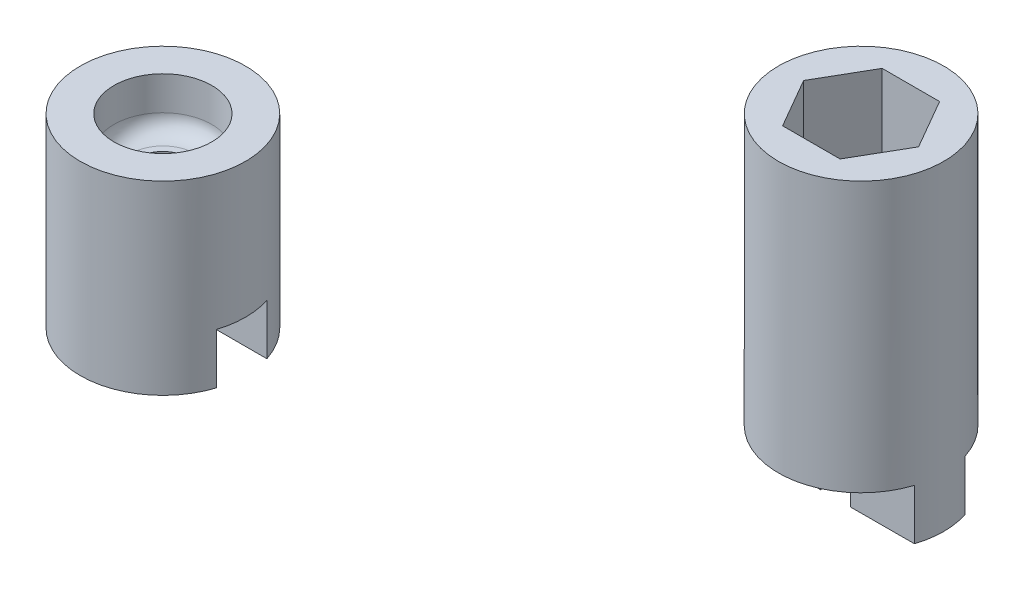
ISO-10303-21;
HEADER;
FILE_DESCRIPTION(('STEP AP214'),'2;1');
FILE_NAME('part.step','',(''),(''),'','','');
FILE_SCHEMA(('AUTOMOTIVE_DESIGN { 1 0 10303 214 1 1 1 1 }'));
ENDSEC;
DATA;
#1=APPLICATION_CONTEXT('core data for automotive mechanical design processes');
#2=APPLICATION_PROTOCOL_DEFINITION('international standard','automotive_design',2000,#1);
#3=PRODUCT_CONTEXT('',#1,'mechanical');
#4=PRODUCT('Part','Part','',(#3));
#5=PRODUCT_RELATED_PRODUCT_CATEGORY('part','',(#4));
#6=PRODUCT_DEFINITION_FORMATION('','',#4);
#7=PRODUCT_DEFINITION_CONTEXT('part definition',#1,'design');
#8=PRODUCT_DEFINITION('design','',#6,#7);
#9=PRODUCT_DEFINITION_SHAPE('','',#8);
#10=(LENGTH_UNIT() NAMED_UNIT(*) SI_UNIT(.MILLI.,.METRE.));
#11=(NAMED_UNIT(*) PLANE_ANGLE_UNIT() SI_UNIT($,.RADIAN.));
#12=(NAMED_UNIT(*) SI_UNIT($,.STERADIAN.) SOLID_ANGLE_UNIT());
#13=UNCERTAINTY_MEASURE_WITH_UNIT(LENGTH_MEASURE(1.E-05),#10,'distance_accuracy_value','');
#14=(GEOMETRIC_REPRESENTATION_CONTEXT(3) GLOBAL_UNCERTAINTY_ASSIGNED_CONTEXT((#13)) GLOBAL_UNIT_ASSIGNED_CONTEXT((#10,
#11,#12)) REPRESENTATION_CONTEXT('',''));
#15=CARTESIAN_POINT('',(0.,0.,0.));
#16=DIRECTION('',(0.,0.,1.));
#17=DIRECTION('',(1.,0.,0.));
#18=AXIS2_PLACEMENT_3D('',#15,#16,#17);
#19=CARTESIAN_POINT('',(18.8446435899789,-5.,42.9309833986757));
#20=DIRECTION('',(0.,-1.,0.));
#21=DIRECTION('',(0.,0.,-1.));
#22=AXIS2_PLACEMENT_3D('',#19,#20,#21);
#23=CYLINDRICAL_SURFACE('',#22,4.9);
#24=CARTESIAN_POINT('',(18.8446435899789,-56.,42.9309833986757));
#25=DIRECTION('',(0.,1.,0.));
#26=DIRECTION('',(0.,0.,1.));
#27=AXIS2_PLACEMENT_3D('',#24,#25,#26);
#28=CIRCLE('',#27,4.9);
#29=CARTESIAN_POINT('',(14.1800476853389,-56.,41.4304684715869));
#30=VERTEX_POINT('',#29);
#31=CARTESIAN_POINT('',(23.5092394946188,-56.,41.4304684715869));
#32=VERTEX_POINT('',#31);
#33=EDGE_CURVE('E277',#30,#32,#28,.F.);
#34=ORIENTED_EDGE('',*,*,#33,.F.);
#35=DIRECTION('',(0.,-1.,0.));
#36=VECTOR('',#35,1.);
#37=CARTESIAN_POINT('',(14.1800476853389,-5.,41.4304684715869));
#38=LINE('',#37,#36);
#39=CARTESIAN_POINT('',(14.1800476853389,-59.,41.4304684715869));
#40=VERTEX_POINT('',#39);
#41=EDGE_CURVE('E245',#30,#40,#38,.T.);
#42=ORIENTED_EDGE('',*,*,#41,.T.);
#43=CARTESIAN_POINT('',(18.8446435899789,-59.,42.9309833986757));
#44=DIRECTION('',(0.,-1.,0.));
#45=DIRECTION('',(0.,0.,-1.));
#46=AXIS2_PLACEMENT_3D('',#43,#44,#45);
#47=CIRCLE('',#46,4.9);
#48=CARTESIAN_POINT('',(14.1800476853389,-59.,44.4314983257645));
#49=VERTEX_POINT('',#48);
#50=EDGE_CURVE('E235',#49,#40,#47,.T.);
#51=ORIENTED_EDGE('',*,*,#50,.F.);
#52=DIRECTION('',(0.,-1.,0.));
#53=VECTOR('',#52,1.);
#54=CARTESIAN_POINT('',(14.1800476853389,-5.,44.4314983257645));
#55=LINE('',#54,#53);
#56=CARTESIAN_POINT('',(14.1800476853389,-56.,44.4314983257645));
#57=VERTEX_POINT('',#56);
#58=EDGE_CURVE('E241',#49,#57,#55,.F.);
#59=ORIENTED_EDGE('',*,*,#58,.T.);
#60=CARTESIAN_POINT('',(23.5092394946188,-56.,44.4314983257645));
#61=VERTEX_POINT('',#60);
#62=EDGE_CURVE('E272',#61,#57,#28,.F.);
#63=ORIENTED_EDGE('',*,*,#62,.F.);
#64=DIRECTION('',(0.,-1.,0.));
#65=VECTOR('',#64,1.);
#66=CARTESIAN_POINT('',(23.5092394946188,-5.,44.4314983257645));
#67=LINE('',#66,#65);
#68=CARTESIAN_POINT('',(23.5092394946188,-59.,44.4314983257645));
#69=VERTEX_POINT('',#68);
#70=EDGE_CURVE('E244',#61,#69,#67,.T.);
#71=ORIENTED_EDGE('',*,*,#70,.T.);
#72=CARTESIAN_POINT('',(23.5092394946188,-59.,41.4304684715869));
#73=VERTEX_POINT('',#72);
#74=EDGE_CURVE('E231',#73,#69,#47,.T.);
#75=ORIENTED_EDGE('',*,*,#74,.F.);
#76=DIRECTION('',(0.,-1.,0.));
#77=VECTOR('',#76,1.);
#78=CARTESIAN_POINT('',(23.5092394946188,-5.,41.4304684715869));
#79=LINE('',#78,#77);
#80=EDGE_CURVE('E248',#73,#32,#79,.F.);
#81=ORIENTED_EDGE('',*,*,#80,.T.);
#82=EDGE_LOOP('',(#34,#42,#51,#59,#63,#71,#75,#81));
#83=FACE_BOUND('',#82,.T.);
#84=CARTESIAN_POINT('',(18.8446435899789,-40.,42.9309833986757));
#85=DIRECTION('',(0.,1.,0.));
#86=DIRECTION('',(0.,0.,1.));
#87=AXIS2_PLACEMENT_3D('',#84,#85,#86);
#88=CIRCLE('',#87,4.9);
#89=CARTESIAN_POINT('',(18.8446435899789,-40.,47.8309833986757));
#90=VERTEX_POINT('',#89);
#91=EDGE_CURVE('E211',#90,#90,#88,.F.);
#92=ORIENTED_EDGE('',*,*,#91,.T.);
#93=EDGE_LOOP('',(#92));
#94=FACE_BOUND('',#93,.T.);
#95=ADVANCED_FACE('F49',(#83,#94),#23,.T.);
#96=CARTESIAN_POINT('',(20.5478268840883,-53.,45.8809833986757));
#97=DIRECTION('',(0.866025403784439,0.,0.5));
#98=DIRECTION('',(0.5,0.,-0.866025403784439));
#99=AXIS2_PLACEMENT_3D('',#96,#97,#98);
#100=PLANE('',#99);
#101=DIRECTION('',(-0.5,0.,0.866025403784439));
#102=VECTOR('',#101,1.);
#103=CARTESIAN_POINT('',(20.5478268840883,-40.,45.8809833986757));
#104=LINE('',#103,#102);
#105=CARTESIAN_POINT('',(22.2510101781977,-40.,42.9309833986757));
#106=VERTEX_POINT('',#105);
#107=CARTESIAN_POINT('',(20.5478268840883,-40.,45.8809833986757));
#108=VERTEX_POINT('',#107);
#109=EDGE_CURVE('E260',#106,#108,#104,.T.);
#110=ORIENTED_EDGE('',*,*,#109,.F.);
#111=DIRECTION('',(0.,1.,0.));
#112=VECTOR('',#111,1.);
#113=CARTESIAN_POINT('',(22.2510101781977,-53.,42.9309833986757));
#114=LINE('',#113,#112);
#115=CARTESIAN_POINT('',(22.2510101781977,-52.,42.9309833986757));
#116=VERTEX_POINT('',#115);
#117=EDGE_CURVE('E53',#116,#106,#114,.T.);
#118=ORIENTED_EDGE('',*,*,#117,.F.);
#119=DIRECTION('',(0.5,0.,-0.866025403784439));
#120=VECTOR('',#119,1.);
#121=CARTESIAN_POINT('',(20.5478268840883,-52.,45.8809833986757));
#122=LINE('',#121,#120);
#123=CARTESIAN_POINT('',(20.5478268840883,-52.,45.8809833986757));
#124=VERTEX_POINT('',#123);
#125=EDGE_CURVE('E208',#116,#124,#122,.F.);
#126=ORIENTED_EDGE('',*,*,#125,.T.);
#127=DIRECTION('',(0.,1.,0.));
#128=VECTOR('',#127,1.);
#129=CARTESIAN_POINT('',(20.5478268840883,-53.,45.8809833986757));
#130=LINE('',#129,#128);
#131=EDGE_CURVE('E210',#124,#108,#130,.T.);
#132=ORIENTED_EDGE('',*,*,#131,.T.);
#133=EDGE_LOOP('',(#110,#118,#126,#132));
#134=FACE_BOUND('',#133,.T.);
#135=ADVANCED_FACE('F51',(#134),#100,.F.);
#136=CARTESIAN_POINT('',(17.1414602958695,-53.,45.8809833986757));
#137=DIRECTION('',(0.,0.,1.));
#138=DIRECTION('',(1.,0.,0.));
#139=AXIS2_PLACEMENT_3D('',#136,#137,#138);
#140=PLANE('',#139);
#141=DIRECTION('',(-1.,0.,0.));
#142=VECTOR('',#141,1.);
#143=CARTESIAN_POINT('',(17.1414602958695,-40.,45.8809833986757));
#144=LINE('',#143,#142);
#145=CARTESIAN_POINT('',(17.1414602958695,-40.,45.8809833986757));
#146=VERTEX_POINT('',#145);
#147=EDGE_CURVE('E168',#108,#146,#144,.T.);
#148=ORIENTED_EDGE('',*,*,#147,.F.);
#149=ORIENTED_EDGE('',*,*,#131,.F.);
#150=DIRECTION('',(1.,0.,0.));
#151=VECTOR('',#150,1.);
#152=CARTESIAN_POINT('',(17.1414602958695,-52.,45.8809833986757));
#153=LINE('',#152,#151);
#154=CARTESIAN_POINT('',(17.1414602958695,-52.,45.8809833986757));
#155=VERTEX_POINT('',#154);
#156=EDGE_CURVE('E212',#124,#155,#153,.F.);
#157=ORIENTED_EDGE('',*,*,#156,.T.);
#158=DIRECTION('',(0.,1.,0.));
#159=VECTOR('',#158,1.);
#160=CARTESIAN_POINT('',(17.1414602958695,-53.,45.8809833986757));
#161=LINE('',#160,#159);
#162=EDGE_CURVE('E190',#155,#146,#161,.T.);
#163=ORIENTED_EDGE('',*,*,#162,.T.);
#164=EDGE_LOOP('',(#148,#149,#157,#163));
#165=FACE_BOUND('',#164,.T.);
#166=ADVANCED_FACE('F300',(#165),#140,.F.);
#167=CARTESIAN_POINT('',(15.4382770017601,-53.,42.9309833986757));
#168=DIRECTION('',(-0.866025403784439,0.,0.5));
#169=DIRECTION('',(0.5,0.,0.866025403784439));
#170=AXIS2_PLACEMENT_3D('',#167,#168,#169);
#171=PLANE('',#170);
#172=DIRECTION('',(-0.5,0.,-0.866025403784439));
#173=VECTOR('',#172,1.);
#174=CARTESIAN_POINT('',(15.4382770017601,-40.,42.9309833986757));
#175=LINE('',#174,#173);
#176=CARTESIAN_POINT('',(15.4382770017601,-40.,42.9309833986757));
#177=VERTEX_POINT('',#176);
#178=EDGE_CURVE('E163',#146,#177,#175,.T.);
#179=ORIENTED_EDGE('',*,*,#178,.F.);
#180=ORIENTED_EDGE('',*,*,#162,.F.);
#181=DIRECTION('',(0.5,0.,0.866025403784439));
#182=VECTOR('',#181,1.);
#183=CARTESIAN_POINT('',(15.4382770017601,-52.,42.9309833986757));
#184=LINE('',#183,#182);
#185=CARTESIAN_POINT('',(15.4382770017601,-52.,42.9309833986757));
#186=VERTEX_POINT('',#185);
#187=EDGE_CURVE('E186',#155,#186,#184,.F.);
#188=ORIENTED_EDGE('',*,*,#187,.T.);
#189=DIRECTION('',(0.,1.,0.));
#190=VECTOR('',#189,1.);
#191=CARTESIAN_POINT('',(15.4382770017601,-53.,42.9309833986757));
#192=LINE('',#191,#190);
#193=EDGE_CURVE('E179',#186,#177,#192,.T.);
#194=ORIENTED_EDGE('',*,*,#193,.T.);
#195=EDGE_LOOP('',(#179,#180,#188,#194));
#196=FACE_BOUND('',#195,.T.);
#197=ADVANCED_FACE('F184',(#196),#171,.F.);
#198=CARTESIAN_POINT('',(17.1414602958695,-53.,39.9809833986757));
#199=DIRECTION('',(-0.866025403784438,0.,-0.500000000000001));
#200=DIRECTION('',(-0.500000000000001,0.,0.866025403784438));
#201=AXIS2_PLACEMENT_3D('',#198,#199,#200);
#202=PLANE('',#201);
#203=DIRECTION('',(0.500000000000001,0.,-0.866025403784438));
#204=VECTOR('',#203,1.);
#205=CARTESIAN_POINT('',(17.1414602958695,-40.,39.9809833986757));
#206=LINE('',#205,#204);
#207=CARTESIAN_POINT('',(17.1414602958695,-40.,39.9809833986757));
#208=VERTEX_POINT('',#207);
#209=EDGE_CURVE('E166',#177,#208,#206,.T.);
#210=ORIENTED_EDGE('',*,*,#209,.F.);
#211=ORIENTED_EDGE('',*,*,#193,.F.);
#212=DIRECTION('',(-0.500000000000001,0.,0.866025403784438));
#213=VECTOR('',#212,1.);
#214=CARTESIAN_POINT('',(17.1414602958695,-52.,39.9809833986757));
#215=LINE('',#214,#213);
#216=CARTESIAN_POINT('',(17.1414602958695,-52.,39.9809833986757));
#217=VERTEX_POINT('',#216);
#218=EDGE_CURVE('E187',#186,#217,#215,.F.);
#219=ORIENTED_EDGE('',*,*,#218,.T.);
#220=DIRECTION('',(0.,1.,0.));
#221=VECTOR('',#220,1.);
#222=CARTESIAN_POINT('',(17.1414602958695,-53.,39.9809833986757));
#223=LINE('',#222,#221);
#224=EDGE_CURVE('E182',#217,#208,#223,.T.);
#225=ORIENTED_EDGE('',*,*,#224,.T.);
#226=EDGE_LOOP('',(#210,#211,#219,#225));
#227=FACE_BOUND('',#226,.T.);
#228=ADVANCED_FACE('F177',(#227),#202,.F.);
#229=CARTESIAN_POINT('',(20.5478268840883,-53.,39.9809833986757));
#230=DIRECTION('',(0.,0.,-1.));
#231=DIRECTION('',(-1.,0.,0.));
#232=AXIS2_PLACEMENT_3D('',#229,#230,#231);
#233=PLANE('',#232);
#234=DIRECTION('',(1.,0.,0.));
#235=VECTOR('',#234,1.);
#236=CARTESIAN_POINT('',(20.5478268840883,-40.,39.9809833986757));
#237=LINE('',#236,#235);
#238=CARTESIAN_POINT('',(20.5478268840883,-40.,39.9809833986757));
#239=VERTEX_POINT('',#238);
#240=EDGE_CURVE('E58',#208,#239,#237,.T.);
#241=ORIENTED_EDGE('',*,*,#240,.F.);
#242=ORIENTED_EDGE('',*,*,#224,.F.);
#243=DIRECTION('',(-1.,0.,0.));
#244=VECTOR('',#243,1.);
#245=CARTESIAN_POINT('',(20.5478268840883,-52.,39.9809833986757));
#246=LINE('',#245,#244);
#247=CARTESIAN_POINT('',(20.5478268840883,-52.,39.9809833986757));
#248=VERTEX_POINT('',#247);
#249=EDGE_CURVE('E195',#217,#248,#246,.F.);
#250=ORIENTED_EDGE('',*,*,#249,.T.);
#251=DIRECTION('',(0.,1.,0.));
#252=VECTOR('',#251,1.);
#253=CARTESIAN_POINT('',(20.5478268840883,-53.,39.9809833986757));
#254=LINE('',#253,#252);
#255=EDGE_CURVE('E196',#248,#239,#254,.T.);
#256=ORIENTED_EDGE('',*,*,#255,.T.);
#257=EDGE_LOOP('',(#241,#242,#250,#256));
#258=FACE_BOUND('',#257,.T.);
#259=ADVANCED_FACE('F403',(#258),#233,.F.);
#260=CARTESIAN_POINT('',(22.2510101781977,-53.,42.9309833986757));
#261=DIRECTION('',(0.866025403784438,0.,-0.500000000000001));
#262=DIRECTION('',(-0.500000000000001,0.,-0.866025403784438));
#263=AXIS2_PLACEMENT_3D('',#260,#261,#262);
#264=PLANE('',#263);
#265=DIRECTION('',(0.500000000000001,0.,0.866025403784438));
#266=VECTOR('',#265,1.);
#267=CARTESIAN_POINT('',(22.2510101781977,-40.,42.9309833986757));
#268=LINE('',#267,#266);
#269=EDGE_CURVE('E12',#239,#106,#268,.T.);
#270=ORIENTED_EDGE('',*,*,#269,.F.);
#271=ORIENTED_EDGE('',*,*,#255,.F.);
#272=DIRECTION('',(-0.500000000000001,0.,-0.866025403784438));
#273=VECTOR('',#272,1.);
#274=CARTESIAN_POINT('',(22.2510101781977,-52.,42.9309833986757));
#275=LINE('',#274,#273);
#276=EDGE_CURVE('E198',#248,#116,#275,.F.);
#277=ORIENTED_EDGE('',*,*,#276,.T.);
#278=ORIENTED_EDGE('',*,*,#117,.T.);
#279=EDGE_LOOP('',(#270,#271,#277,#278));
#280=FACE_BOUND('',#279,.T.);
#281=ADVANCED_FACE('F398',(#280),#264,.F.);
#282=CARTESIAN_POINT('',(18.8446435899789,-59.,42.9309833986757));
#283=DIRECTION('',(0.,-1.,0.));
#284=DIRECTION('',(0.,0.,-1.));
#285=AXIS2_PLACEMENT_3D('',#282,#283,#284);
#286=PLANE('',#285);
#287=DIRECTION('',(-0.999997607610451,0.,0.00218741248368964));
#288=VECTOR('',#287,1.);
#289=CARTESIAN_POINT('',(17.9735300804357,-59.,41.4221705409873));
#290=LINE('',#289,#288);
#291=CARTESIAN_POINT('',(17.9735300804357,-59.,41.4221705409873));
#292=VERTEX_POINT('',#291);
#293=EDGE_CURVE('E256',#292,#40,#290,.T.);
#294=ORIENTED_EDGE('',*,*,#293,.F.);
#295=CARTESIAN_POINT('',(18.8446435899789,-59.,42.9309833986757));
#296=DIRECTION('',(0.,-1.,0.));
#297=DIRECTION('',(0.,0.,-1.));
#298=AXIS2_PLACEMENT_3D('',#295,#296,#297);
#299=CIRCLE('',#298,1.74222701908631);
#300=CARTESIAN_POINT('',(17.9735300804357,-59.,44.4397962563641));
#301=VERTEX_POINT('',#300);
#302=EDGE_CURVE('E261',#301,#292,#299,.T.);
#303=ORIENTED_EDGE('',*,*,#302,.F.);
#304=DIRECTION('',(-0.999997607610451,0.,-0.00218741248368621));
#305=VECTOR('',#304,1.);
#306=CARTESIAN_POINT('',(18.8413390337135,-59.,44.4416945170433));
#307=LINE('',#306,#305);
#308=EDGE_CURVE('E332',#301,#49,#307,.T.);
#309=ORIENTED_EDGE('',*,*,#308,.T.);
#310=ORIENTED_EDGE('',*,*,#50,.T.);
#311=EDGE_LOOP('',(#294,#303,#309,#310));
#312=FACE_BOUND('',#311,.T.);
#313=ADVANCED_FACE('F366',(#312),#286,.T.);
#314=DIRECTION('',(0.999997607610451,0.,-0.00218741248368965));
#315=VECTOR('',#314,1.);
#316=CARTESIAN_POINT('',(19.715757099522,-59.,44.4397962563641));
#317=LINE('',#316,#315);
#318=CARTESIAN_POINT('',(19.715757099522,-59.,44.4397962563641));
#319=VERTEX_POINT('',#318);
#320=EDGE_CURVE('E240',#319,#69,#317,.T.);
#321=ORIENTED_EDGE('',*,*,#320,.F.);
#322=CARTESIAN_POINT('',(19.715757099522,-59.,41.4221705409874));
#323=VERTEX_POINT('',#322);
#324=EDGE_CURVE('E268',#323,#319,#299,.T.);
#325=ORIENTED_EDGE('',*,*,#324,.F.);
#326=DIRECTION('',(0.999997607610451,0.,0.00218741248368449));
#327=VECTOR('',#326,1.);
#328=CARTESIAN_POINT('',(18.8479481462442,-59.,41.4202722803081));
#329=LINE('',#328,#327);
#330=EDGE_CURVE('E234',#323,#73,#329,.T.);
#331=ORIENTED_EDGE('',*,*,#330,.T.);
#332=ORIENTED_EDGE('',*,*,#74,.T.);
#333=EDGE_LOOP('',(#321,#325,#331,#332));
#334=FACE_BOUND('',#333,.T.);
#335=ADVANCED_FACE('F350',(#334),#286,.T.);
#336=CARTESIAN_POINT('',(18.8446435899789,-61.,42.9309833986757));
#337=DIRECTION('',(0.,1.,0.));
#338=DIRECTION('',(0.,0.,1.));
#339=AXIS2_PLACEMENT_3D('',#336,#337,#338);
#340=CYLINDRICAL_SURFACE('',#339,1.5);
#341=CARTESIAN_POINT('',(18.8446435899789,-53.,42.9309833986757));
#342=DIRECTION('',(0.,1.,0.));
#343=DIRECTION('',(0.,0.,1.));
#344=AXIS2_PLACEMENT_3D('',#341,#342,#343);
#345=CIRCLE('',#344,1.5);
#346=CARTESIAN_POINT('',(18.8446435899789,-53.,44.4309833986757));
#347=VERTEX_POINT('',#346);
#348=EDGE_CURVE('E228',#347,#347,#345,.T.);
#349=ORIENTED_EDGE('',*,*,#348,.T.);
#350=EDGE_LOOP('',(#349));
#351=FACE_BOUND('',#350,.T.);
#352=CARTESIAN_POINT('',(18.8446435899789,-56.,42.9309833986757));
#353=DIRECTION('',(0.,1.,0.));
#354=DIRECTION('',(0.,0.,1.));
#355=AXIS2_PLACEMENT_3D('',#352,#353,#354);
#356=CIRCLE('',#355,1.5);
#357=CARTESIAN_POINT('',(18.8446435899789,-56.,44.4309833986757));
#358=VERTEX_POINT('',#357);
#359=EDGE_CURVE('E236',#358,#358,#356,.T.);
#360=ORIENTED_EDGE('',*,*,#359,.F.);
#361=EDGE_LOOP('',(#360));
#362=FACE_BOUND('',#361,.T.);
#363=ADVANCED_FACE('F389',(#351,#362),#340,.F.);
#364=CARTESIAN_POINT('',(0.,-53.,0.));
#365=DIRECTION('',(0.,1.,0.));
#366=DIRECTION('',(0.,0.,1.));
#367=AXIS2_PLACEMENT_3D('',#364,#365,#366);
#368=PLANE('',#367);
#369=DIRECTION('',(-1.,0.,0.));
#370=VECTOR('',#369,1.);
#371=CARTESIAN_POINT('',(0.,-53.,40.9809833986757));
#372=LINE('',#371,#370);
#373=CARTESIAN_POINT('',(19.9704766148986,-53.,40.9809833986757));
#374=VERTEX_POINT('',#373);
#375=CARTESIAN_POINT('',(17.7188105650591,-53.,40.9809833986757));
#376=VERTEX_POINT('',#375);
#377=EDGE_CURVE('E218',#374,#376,#372,.T.);
#378=ORIENTED_EDGE('',*,*,#377,.T.);
#379=DIRECTION('',(-0.500000000000001,0.,0.866025403784438));
#380=VECTOR('',#379,1.);
#381=CARTESIAN_POINT('',(31.0343942714551,-53.,17.9177158867616));
#382=LINE('',#381,#380);
#383=CARTESIAN_POINT('',(16.5929775401393,-53.,42.9309833986757));
#384=VERTEX_POINT('',#383);
#385=EDGE_CURVE('E214',#376,#384,#382,.T.);
#386=ORIENTED_EDGE('',*,*,#385,.T.);
#387=DIRECTION('',(0.5,0.,0.866025403784439));
#388=VECTOR('',#387,1.);
#389=CARTESIAN_POINT('',(-6.14492796124608,-53.,3.54777581257628));
#390=LINE('',#389,#388);
#391=CARTESIAN_POINT('',(17.7188105650591,-53.,44.8809833986757));
#392=VERTEX_POINT('',#391);
#393=EDGE_CURVE('E217',#384,#392,#390,.T.);
#394=ORIENTED_EDGE('',*,*,#393,.T.);
#395=DIRECTION('',(1.,0.,0.));
#396=VECTOR('',#395,1.);
#397=CARTESIAN_POINT('',(0.,-53.,44.8809833986757));
#398=LINE('',#397,#396);
#399=CARTESIAN_POINT('',(19.9704766148986,-53.,44.8809833986757));
#400=VERTEX_POINT('',#399);
#401=EDGE_CURVE('E220',#392,#400,#398,.T.);
#402=ORIENTED_EDGE('',*,*,#401,.T.);
#403=DIRECTION('',(0.5,0.,-0.866025403784439));
#404=VECTOR('',#403,1.);
#405=CARTESIAN_POINT('',(34.4118933462144,-53.,19.8677158867616));
#406=LINE('',#405,#404);
#407=CARTESIAN_POINT('',(21.0963096398184,-53.,42.9309833986757));
#408=VERTEX_POINT('',#407);
#409=EDGE_CURVE('E222',#400,#408,#406,.T.);
#410=ORIENTED_EDGE('',*,*,#409,.T.);
#411=DIRECTION('',(-0.500000000000001,0.,-0.866025403784438));
#412=VECTOR('',#411,1.);
#413=CARTESIAN_POINT('',(-2.76742888648683,-53.,1.59777581257632));
#414=LINE('',#413,#412);
#415=EDGE_CURVE('E224',#408,#374,#414,.T.);
#416=ORIENTED_EDGE('',*,*,#415,.T.);
#417=EDGE_LOOP('',(#378,#386,#394,#402,#410,#416));
#418=FACE_BOUND('',#417,.T.);
#419=ORIENTED_EDGE('',*,*,#348,.F.);
#420=EDGE_LOOP('',(#419));
#421=FACE_BOUND('',#420,.T.);
#422=ADVANCED_FACE('F392',(#418,#421),#368,.T.);
#423=CARTESIAN_POINT('',(34.4118933462144,-52.,19.8677158867616));
#424=DIRECTION('',(0.5,0.,-0.866025403784439));
#425=DIRECTION('',(-0.866025403784439,0.,-0.5));
#426=AXIS2_PLACEMENT_3D('',#423,#424,#425);
#427=CYLINDRICAL_SURFACE('',#426,1.);
#428=CARTESIAN_POINT('',(19.9704766148986,-52.,44.8809833986757));
#429=DIRECTION('',(0.866025403784439,0.,-0.5));
#430=DIRECTION('',(0.5,0.,0.866025403784439));
#431=AXIS2_PLACEMENT_3D('',#428,#429,#430);
#432=ELLIPSE('',#431,1.15470053837925,1.);
#433=EDGE_CURVE('E305',#124,#400,#432,.T.);
#434=ORIENTED_EDGE('',*,*,#433,.F.);
#435=ORIENTED_EDGE('',*,*,#125,.F.);
#436=CARTESIAN_POINT('',(21.0963096398184,-52.,42.9309833986757));
#437=DIRECTION('',(0.,0.,-1.));
#438=DIRECTION('',(1.,0.,0.));
#439=AXIS2_PLACEMENT_3D('',#436,#437,#438);
#440=ELLIPSE('',#439,1.15470053837925,1.);
#441=EDGE_CURVE('E226',#408,#116,#440,.F.);
#442=ORIENTED_EDGE('',*,*,#441,.F.);
#443=ORIENTED_EDGE('',*,*,#409,.F.);
#444=EDGE_LOOP('',(#434,#435,#442,#443));
#445=FACE_BOUND('',#444,.T.);
#446=ADVANCED_FACE('F306',(#445),#427,.F.);
#447=CARTESIAN_POINT('',(-2.76742888648683,-52.,1.59777581257632));
#448=DIRECTION('',(-0.500000000000001,0.,-0.866025403784438));
#449=DIRECTION('',(-0.866025403784438,0.,0.500000000000001));
#450=AXIS2_PLACEMENT_3D('',#447,#448,#449);
#451=CYLINDRICAL_SURFACE('',#450,1.);
#452=ORIENTED_EDGE('',*,*,#441,.T.);
#453=ORIENTED_EDGE('',*,*,#276,.F.);
#454=CARTESIAN_POINT('',(19.9704766148986,-52.,40.9809833986757));
#455=DIRECTION('',(-0.866025403784439,0.,-0.5));
#456=DIRECTION('',(0.5,0.,-0.866025403784439));
#457=AXIS2_PLACEMENT_3D('',#454,#455,#456);
#458=ELLIPSE('',#457,1.15470053837925,1.);
#459=EDGE_CURVE('E311',#374,#248,#458,.F.);
#460=ORIENTED_EDGE('',*,*,#459,.F.);
#461=ORIENTED_EDGE('',*,*,#415,.F.);
#462=EDGE_LOOP('',(#452,#453,#460,#461));
#463=FACE_BOUND('',#462,.T.);
#464=ADVANCED_FACE('F470',(#463),#451,.F.);
#465=CARTESIAN_POINT('',(0.,-52.,44.8809833986757));
#466=DIRECTION('',(1.,0.,0.));
#467=DIRECTION('',(0.,0.,-1.));
#468=AXIS2_PLACEMENT_3D('',#465,#466,#467);
#469=CYLINDRICAL_SURFACE('',#468,1.);
#470=ORIENTED_EDGE('',*,*,#433,.T.);
#471=ORIENTED_EDGE('',*,*,#401,.F.);
#472=CARTESIAN_POINT('',(17.7188105650591,-52.,44.8809833986757));
#473=DIRECTION('',(0.866025403784438,0.,0.5));
#474=DIRECTION('',(-0.5,0.,0.866025403784439));
#475=AXIS2_PLACEMENT_3D('',#472,#473,#474);
#476=ELLIPSE('',#475,1.15470053837925,1.);
#477=EDGE_CURVE('E316',#155,#392,#476,.T.);
#478=ORIENTED_EDGE('',*,*,#477,.F.);
#479=ORIENTED_EDGE('',*,*,#156,.F.);
#480=EDGE_LOOP('',(#470,#471,#478,#479));
#481=FACE_BOUND('',#480,.T.);
#482=ADVANCED_FACE('F314',(#481),#469,.F.);
#483=CARTESIAN_POINT('',(0.,-52.,40.9809833986757));
#484=DIRECTION('',(-1.,0.,0.));
#485=DIRECTION('',(0.,0.,1.));
#486=AXIS2_PLACEMENT_3D('',#483,#484,#485);
#487=CYLINDRICAL_SURFACE('',#486,1.);
#488=ORIENTED_EDGE('',*,*,#459,.T.);
#489=ORIENTED_EDGE('',*,*,#249,.F.);
#490=CARTESIAN_POINT('',(17.7188105650591,-52.,40.9809833986757));
#491=DIRECTION('',(-0.866025403784439,0.,0.5));
#492=DIRECTION('',(0.499999999999999,0.,0.866025403784439));
#493=AXIS2_PLACEMENT_3D('',#490,#491,#492);
#494=ELLIPSE('',#493,1.15470053837925,1.);
#495=EDGE_CURVE('E319',#376,#217,#494,.F.);
#496=ORIENTED_EDGE('',*,*,#495,.F.);
#497=ORIENTED_EDGE('',*,*,#377,.F.);
#498=EDGE_LOOP('',(#488,#489,#496,#497));
#499=FACE_BOUND('',#498,.T.);
#500=ADVANCED_FACE('F488',(#499),#487,.F.);
#501=CARTESIAN_POINT('',(-6.14492796124608,-52.,3.54777581257628));
#502=DIRECTION('',(0.5,0.,0.866025403784439));
#503=DIRECTION('',(0.866025403784439,0.,-0.5));
#504=AXIS2_PLACEMENT_3D('',#501,#502,#503);
#505=CYLINDRICAL_SURFACE('',#504,1.);
#506=ORIENTED_EDGE('',*,*,#477,.T.);
#507=ORIENTED_EDGE('',*,*,#393,.F.);
#508=CARTESIAN_POINT('',(16.5929775401393,-52.,42.9309833986757));
#509=DIRECTION('',(0.,0.,1.));
#510=DIRECTION('',(-1.,0.,0.));
#511=AXIS2_PLACEMENT_3D('',#508,#509,#510);
#512=ELLIPSE('',#511,1.15470053837925,1.);
#513=EDGE_CURVE('E205',#186,#384,#512,.T.);
#514=ORIENTED_EDGE('',*,*,#513,.F.);
#515=ORIENTED_EDGE('',*,*,#187,.F.);
#516=EDGE_LOOP('',(#506,#507,#514,#515));
#517=FACE_BOUND('',#516,.T.);
#518=ADVANCED_FACE('F322',(#517),#505,.F.);
#519=CARTESIAN_POINT('',(31.0343942714551,-52.,17.9177158867616));
#520=DIRECTION('',(-0.500000000000001,0.,0.866025403784438));
#521=DIRECTION('',(0.866025403784438,0.,0.500000000000001));
#522=AXIS2_PLACEMENT_3D('',#519,#520,#521);
#523=CYLINDRICAL_SURFACE('',#522,1.);
#524=ORIENTED_EDGE('',*,*,#495,.T.);
#525=ORIENTED_EDGE('',*,*,#218,.F.);
#526=ORIENTED_EDGE('',*,*,#513,.T.);
#527=ORIENTED_EDGE('',*,*,#385,.F.);
#528=EDGE_LOOP('',(#524,#525,#526,#527));
#529=FACE_BOUND('',#528,.T.);
#530=ADVANCED_FACE('F379',(#529),#523,.F.);
#531=CARTESIAN_POINT('',(13.9446435899789,-59.,44.4309833986757));
#532=DIRECTION('',(-0.00218741248368621,0.,0.999997607610451));
#533=DIRECTION('',(0.999997607610451,0.,0.00218741248368621));
#534=AXIS2_PLACEMENT_3D('',#531,#532,#533);
#535=PLANE('',#534);
#536=ORIENTED_EDGE('',*,*,#308,.F.);
#537=DIRECTION('',(0.,1.,0.));
#538=VECTOR('',#537,1.);
#539=CARTESIAN_POINT('',(17.9735300804357,-59.,44.4397962563641));
#540=LINE('',#539,#538);
#541=CARTESIAN_POINT('',(17.9735300804357,-56.,44.4397962563641));
#542=VERTEX_POINT('',#541);
#543=EDGE_CURVE('E253',#301,#542,#540,.T.);
#544=ORIENTED_EDGE('',*,*,#543,.T.);
#545=DIRECTION('',(0.999997607610451,0.,0.00218741248368621));
#546=VECTOR('',#545,1.);
#547=CARTESIAN_POINT('',(13.9446435899789,-56.,44.4309833986757));
#548=LINE('',#547,#546);
#549=EDGE_CURVE('E239',#57,#542,#548,.T.);
#550=ORIENTED_EDGE('',*,*,#549,.F.);
#551=ORIENTED_EDGE('',*,*,#58,.F.);
#552=EDGE_LOOP('',(#536,#544,#550,#551));
#553=FACE_BOUND('',#552,.T.);
#554=ADVANCED_FACE('F362',(#553),#535,.T.);
#555=CARTESIAN_POINT('',(17.9735300804357,-59.,41.4221705409873));
#556=DIRECTION('',(-0.00218741248368964,0.,-0.999997607610451));
#557=DIRECTION('',(-0.999997607610451,0.,0.00218741248368964));
#558=AXIS2_PLACEMENT_3D('',#555,#556,#557);
#559=PLANE('',#558);
#560=DIRECTION('',(-0.999997607610451,0.,0.00218741248368964));
#561=VECTOR('',#560,1.);
#562=CARTESIAN_POINT('',(17.9735300804357,-56.,41.4221705409873));
#563=LINE('',#562,#561);
#564=CARTESIAN_POINT('',(17.9735300804357,-56.,41.4221705409873));
#565=VERTEX_POINT('',#564);
#566=EDGE_CURVE('E278',#565,#30,#563,.T.);
#567=ORIENTED_EDGE('',*,*,#566,.F.);
#568=DIRECTION('',(0.,1.,0.));
#569=VECTOR('',#568,1.);
#570=CARTESIAN_POINT('',(17.9735300804357,-59.,41.4221705409873));
#571=LINE('',#570,#569);
#572=EDGE_CURVE('E257',#292,#565,#571,.T.);
#573=ORIENTED_EDGE('',*,*,#572,.F.);
#574=ORIENTED_EDGE('',*,*,#293,.T.);
#575=ORIENTED_EDGE('',*,*,#41,.F.);
#576=EDGE_LOOP('',(#567,#573,#574,#575));
#577=FACE_BOUND('',#576,.T.);
#578=ADVANCED_FACE('F371',(#577),#559,.T.);
#579=CARTESIAN_POINT('',(19.715757099522,-59.,41.4221705409874));
#580=DIRECTION('',(0.00218741248368449,0.,-0.999997607610451));
#581=DIRECTION('',(-0.999997607610451,0.,-0.00218741248368449));
#582=AXIS2_PLACEMENT_3D('',#579,#580,#581);
#583=PLANE('',#582);
#584=ORIENTED_EDGE('',*,*,#330,.F.);
#585=DIRECTION('',(0.,1.,0.));
#586=VECTOR('',#585,1.);
#587=CARTESIAN_POINT('',(19.715757099522,-59.,41.4221705409874));
#588=LINE('',#587,#586);
#589=CARTESIAN_POINT('',(19.715757099522,-56.,41.4221705409874));
#590=VERTEX_POINT('',#589);
#591=EDGE_CURVE('E262',#323,#590,#588,.T.);
#592=ORIENTED_EDGE('',*,*,#591,.T.);
#593=DIRECTION('',(-0.999997607610451,0.,-0.00218741248368449));
#594=VECTOR('',#593,1.);
#595=CARTESIAN_POINT('',(19.715757099522,-56.,41.4221705409874));
#596=LINE('',#595,#594);
#597=EDGE_CURVE('E274',#32,#590,#596,.T.);
#598=ORIENTED_EDGE('',*,*,#597,.F.);
#599=ORIENTED_EDGE('',*,*,#80,.F.);
#600=EDGE_LOOP('',(#584,#592,#598,#599));
#601=FACE_BOUND('',#600,.T.);
#602=ADVANCED_FACE('F345',(#601),#583,.T.);
#603=CARTESIAN_POINT('',(19.715757099522,-59.,44.4397962563641));
#604=DIRECTION('',(0.00218741248368965,0.,0.999997607610451));
#605=DIRECTION('',(0.999997607610451,0.,-0.00218741248368965));
#606=AXIS2_PLACEMENT_3D('',#603,#604,#605);
#607=PLANE('',#606);
#608=DIRECTION('',(0.999997607610451,0.,-0.00218741248368965));
#609=VECTOR('',#608,1.);
#610=CARTESIAN_POINT('',(19.715757099522,-56.,44.4397962563641));
#611=LINE('',#610,#609);
#612=CARTESIAN_POINT('',(19.715757099522,-56.,44.4397962563641));
#613=VERTEX_POINT('',#612);
#614=EDGE_CURVE('E269',#613,#61,#611,.T.);
#615=ORIENTED_EDGE('',*,*,#614,.F.);
#616=DIRECTION('',(0.,1.,0.));
#617=VECTOR('',#616,1.);
#618=CARTESIAN_POINT('',(19.715757099522,-59.,44.4397962563641));
#619=LINE('',#618,#617);
#620=EDGE_CURVE('E265',#319,#613,#619,.T.);
#621=ORIENTED_EDGE('',*,*,#620,.F.);
#622=ORIENTED_EDGE('',*,*,#320,.T.);
#623=ORIENTED_EDGE('',*,*,#70,.F.);
#624=EDGE_LOOP('',(#615,#621,#622,#623));
#625=FACE_BOUND('',#624,.T.);
#626=ADVANCED_FACE('F357',(#625),#607,.T.);
#627=CARTESIAN_POINT('',(0.,-56.,0.));
#628=DIRECTION('',(0.,1.,0.));
#629=DIRECTION('',(0.,0.,1.));
#630=AXIS2_PLACEMENT_3D('',#627,#628,#629);
#631=PLANE('',#630);
#632=ORIENTED_EDGE('',*,*,#359,.T.);
#633=EDGE_LOOP('',(#632));
#634=FACE_BOUND('',#633,.T.);
#635=ORIENTED_EDGE('',*,*,#549,.T.);
#636=CARTESIAN_POINT('',(18.8446435899789,-56.,42.9309833986757));
#637=DIRECTION('',(0.,-1.,0.));
#638=DIRECTION('',(0.,0.,-1.));
#639=AXIS2_PLACEMENT_3D('',#636,#637,#638);
#640=CIRCLE('',#639,1.74222701908631);
#641=EDGE_CURVE('E281',#542,#565,#640,.T.);
#642=ORIENTED_EDGE('',*,*,#641,.T.);
#643=ORIENTED_EDGE('',*,*,#566,.T.);
#644=ORIENTED_EDGE('',*,*,#33,.T.);
#645=ORIENTED_EDGE('',*,*,#597,.T.);
#646=EDGE_CURVE('E273',#590,#613,#640,.T.);
#647=ORIENTED_EDGE('',*,*,#646,.T.);
#648=ORIENTED_EDGE('',*,*,#614,.T.);
#649=ORIENTED_EDGE('',*,*,#62,.T.);
#650=EDGE_LOOP('',(#635,#642,#643,#644,#645,#647,#648,#649));
#651=FACE_BOUND('',#650,.T.);
#652=ADVANCED_FACE('F340',(#634,#651),#631,.F.);
#653=CARTESIAN_POINT('',(18.8446435899789,-59.,42.9309833986757));
#654=DIRECTION('',(0.,1.,0.));
#655=DIRECTION('',(0.,0.,1.));
#656=AXIS2_PLACEMENT_3D('',#653,#654,#655);
#657=CYLINDRICAL_SURFACE('',#656,1.74222701908631);
#658=ORIENTED_EDGE('',*,*,#324,.T.);
#659=ORIENTED_EDGE('',*,*,#620,.T.);
#660=ORIENTED_EDGE('',*,*,#646,.F.);
#661=ORIENTED_EDGE('',*,*,#591,.F.);
#662=EDGE_LOOP('',(#658,#659,#660,#661));
#663=FACE_BOUND('',#662,.T.);
#664=ADVANCED_FACE('F354',(#663),#657,.F.);
#665=ORIENTED_EDGE('',*,*,#302,.T.);
#666=ORIENTED_EDGE('',*,*,#572,.T.);
#667=ORIENTED_EDGE('',*,*,#641,.F.);
#668=ORIENTED_EDGE('',*,*,#543,.F.);
#669=EDGE_LOOP('',(#665,#666,#667,#668));
#670=FACE_BOUND('',#669,.T.);
#671=ADVANCED_FACE('F369',(#670),#657,.F.);
#672=CARTESIAN_POINT('',(18.8446435899789,-40.,42.9309833986757));
#673=DIRECTION('',(0.,1.,0.));
#674=DIRECTION('',(0.,0.,1.));
#675=AXIS2_PLACEMENT_3D('',#672,#673,#674);
#676=PLANE('',#675);
#677=ORIENTED_EDGE('',*,*,#91,.F.);
#678=EDGE_LOOP('',(#677));
#679=FACE_BOUND('',#678,.T.);
#680=ORIENTED_EDGE('',*,*,#109,.T.);
#681=ORIENTED_EDGE('',*,*,#147,.T.);
#682=ORIENTED_EDGE('',*,*,#178,.T.);
#683=ORIENTED_EDGE('',*,*,#209,.T.);
#684=ORIENTED_EDGE('',*,*,#240,.T.);
#685=ORIENTED_EDGE('',*,*,#269,.T.);
#686=EDGE_LOOP('',(#680,#681,#682,#683,#684,#685));
#687=FACE_BOUND('',#686,.T.);
#688=ADVANCED_FACE('F165',(#679,#687),#676,.T.);
#689=CLOSED_SHELL('',(#95,#135,#166,#197,#228,#259,#281,#313,#335,#363,#422,#446,#464,#482,#500,
#518,#530,#554,#578,#602,#626,#652,#664,#671,#688));
#690=MANIFOLD_SOLID_BREP('B2',#689);
#691=CARTESIAN_POINT('',(-1.85085496972547,-51.,63.6264819583804));
#692=DIRECTION('',(0.,1.,0.));
#693=DIRECTION('',(0.,0.,1.));
#694=AXIS2_PLACEMENT_3D('',#691,#692,#693);
#695=CYLINDRICAL_SURFACE('',#694,4.9);
#696=CARTESIAN_POINT('',(-1.85085496972547,-48.,63.6264819583804));
#697=DIRECTION('',(0.,1.,0.));
#698=DIRECTION('',(0.,0.,1.));
#699=AXIS2_PLACEMENT_3D('',#696,#697,#698);
#700=CIRCLE('',#699,4.9);
#701=CARTESIAN_POINT('',(2.81390654615077,-48.,65.1264819583804));
#702=VERTEX_POINT('',#701);
#703=CARTESIAN_POINT('',(2.81390654615077,-48.,62.1264819583804));
#704=VERTEX_POINT('',#703);
#705=EDGE_CURVE('E679',#702,#704,#700,.T.);
#706=ORIENTED_EDGE('',*,*,#705,.T.);
#707=DIRECTION('',(0.,1.,0.));
#708=VECTOR('',#707,1.);
#709=CARTESIAN_POINT('',(2.81390654615077,-51.,62.1264819583804));
#710=LINE('',#709,#708);
#711=CARTESIAN_POINT('',(2.81390654615077,-51.,62.1264819583804));
#712=VERTEX_POINT('',#711);
#713=EDGE_CURVE('E663',#704,#712,#710,.F.);
#714=ORIENTED_EDGE('',*,*,#713,.T.);
#715=CARTESIAN_POINT('',(-1.85085496972547,-51.,63.6264819583804));
#716=DIRECTION('',(0.,-1.,0.));
#717=DIRECTION('',(0.,0.,-1.));
#718=AXIS2_PLACEMENT_3D('',#715,#716,#717);
#719=CIRCLE('',#718,4.9);
#720=CARTESIAN_POINT('',(-6.51561648560171,-51.,62.1264819583804));
#721=VERTEX_POINT('',#720);
#722=EDGE_CURVE('E653',#721,#712,#719,.T.);
#723=ORIENTED_EDGE('',*,*,#722,.F.);
#724=DIRECTION('',(0.,1.,0.));
#725=VECTOR('',#724,1.);
#726=CARTESIAN_POINT('',(-6.51561648560171,-51.,62.1264819583804));
#727=LINE('',#726,#725);
#728=CARTESIAN_POINT('',(-6.51561648560171,-48.,62.1264819583804));
#729=VERTEX_POINT('',#728);
#730=EDGE_CURVE('E658',#721,#729,#727,.T.);
#731=ORIENTED_EDGE('',*,*,#730,.T.);
#732=CARTESIAN_POINT('',(-6.51561648560171,-48.,65.1264819583804));
#733=VERTEX_POINT('',#732);
#734=EDGE_CURVE('E625',#729,#733,#700,.T.);
#735=ORIENTED_EDGE('',*,*,#734,.T.);
#736=DIRECTION('',(0.,1.,0.));
#737=VECTOR('',#736,1.);
#738=CARTESIAN_POINT('',(-6.51561648560171,-51.,65.1264819583804));
#739=LINE('',#738,#737);
#740=CARTESIAN_POINT('',(-6.51561648560171,-51.,65.1264819583804));
#741=VERTEX_POINT('',#740);
#742=EDGE_CURVE('E682',#733,#741,#739,.F.);
#743=ORIENTED_EDGE('',*,*,#742,.T.);
#744=CARTESIAN_POINT('',(2.81390654615076,-51.,65.1264819583804));
#745=VERTEX_POINT('',#744);
#746=EDGE_CURVE('E667',#745,#741,#719,.T.);
#747=ORIENTED_EDGE('',*,*,#746,.F.);
#748=DIRECTION('',(0.,1.,0.));
#749=VECTOR('',#748,1.);
#750=CARTESIAN_POINT('',(2.81390654615077,-51.,65.1264819583804));
#751=LINE('',#750,#749);
#752=EDGE_CURVE('E673',#745,#702,#751,.T.);
#753=ORIENTED_EDGE('',*,*,#752,.T.);
#754=EDGE_LOOP('',(#706,#714,#723,#731,#735,#743,#747,#753));
#755=FACE_BOUND('',#754,.T.);
#756=CARTESIAN_POINT('',(-1.85085496972547,-40.,63.6264819583804));
#757=DIRECTION('',(0.,1.,0.));
#758=DIRECTION('',(0.,0.,1.));
#759=AXIS2_PLACEMENT_3D('',#756,#757,#758);
#760=CIRCLE('',#759,4.9);
#761=CARTESIAN_POINT('',(-1.85085496972547,-40.,68.5264819583804));
#762=VERTEX_POINT('',#761);
#763=EDGE_CURVE('E47',#762,#762,#760,.T.);
#764=ORIENTED_EDGE('',*,*,#763,.F.);
#765=EDGE_LOOP('',(#764));
#766=FACE_BOUND('',#765,.T.);
#767=ADVANCED_FACE('F608',(#755,#766),#695,.T.);
#768=CARTESIAN_POINT('',(-1.85085496972547,-43.,63.6264819583804));
#769=DIRECTION('',(0.,1.,0.));
#770=DIRECTION('',(0.,0.,1.));
#771=AXIS2_PLACEMENT_3D('',#768,#769,#770);
#772=CYLINDRICAL_SURFACE('',#771,2.9);
#773=CARTESIAN_POINT('',(-1.85085496972547,-42.,63.6264819583804));
#774=DIRECTION('',(0.,1.,0.));
#775=DIRECTION('',(0.,0.,1.));
#776=AXIS2_PLACEMENT_3D('',#773,#774,#775);
#777=CIRCLE('',#776,2.9);
#778=CARTESIAN_POINT('',(-1.85085496972547,-42.,66.5264819583804));
#779=VERTEX_POINT('',#778);
#780=EDGE_CURVE('E668',#779,#779,#777,.F.);
#781=ORIENTED_EDGE('',*,*,#780,.T.);
#782=EDGE_LOOP('',(#781));
#783=FACE_BOUND('',#782,.T.);
#784=CARTESIAN_POINT('',(-1.85085496972547,-40.,63.6264819583804));
#785=DIRECTION('',(0.,1.,0.));
#786=DIRECTION('',(0.,0.,1.));
#787=AXIS2_PLACEMENT_3D('',#784,#785,#786);
#788=CIRCLE('',#787,2.9);
#789=CARTESIAN_POINT('',(-1.85085496972547,-40.,66.5264819583804));
#790=VERTEX_POINT('',#789);
#791=EDGE_CURVE('E617',#790,#790,#788,.F.);
#792=ORIENTED_EDGE('',*,*,#791,.F.);
#793=EDGE_LOOP('',(#792));
#794=FACE_BOUND('',#793,.T.);
#795=ADVANCED_FACE('F610',(#783,#794),#772,.F.);
#796=CARTESIAN_POINT('',(-1.85085496972547,-51.,63.6264819583804));
#797=DIRECTION('',(0.,-1.,0.));
#798=DIRECTION('',(0.,0.,-1.));
#799=AXIS2_PLACEMENT_3D('',#796,#797,#798);
#800=PLANE('',#799);
#801=DIRECTION('',(1.,0.,0.));
#802=VECTOR('',#801,1.);
#803=CARTESIAN_POINT('',(-0.98482956594103,-51.,62.1264819583804));
#804=LINE('',#803,#802);
#805=EDGE_CURVE('E647',#721,#712,#804,.T.);
#806=ORIENTED_EDGE('',*,*,#805,.F.);
#807=ORIENTED_EDGE('',*,*,#722,.T.);
#808=EDGE_LOOP('',(#806,#807));
#809=FACE_BOUND('',#808,.T.);
#810=ADVANCED_FACE('F651',(#809),#800,.T.);
#811=DIRECTION('',(-1.,0.,0.));
#812=VECTOR('',#811,1.);
#813=CARTESIAN_POINT('',(-7.47972898960246,-51.,65.1264819583804));
#814=LINE('',#813,#812);
#815=EDGE_CURVE('E654',#745,#741,#814,.T.);
#816=ORIENTED_EDGE('',*,*,#815,.F.);
#817=ORIENTED_EDGE('',*,*,#746,.T.);
#818=EDGE_LOOP('',(#816,#817));
#819=FACE_BOUND('',#818,.T.);
#820=ADVANCED_FACE('F725',(#819),#800,.T.);
#821=CARTESIAN_POINT('',(-1.85085496972547,-43.,63.6264819583804));
#822=DIRECTION('',(0.,1.,0.));
#823=DIRECTION('',(0.,0.,1.));
#824=AXIS2_PLACEMENT_3D('',#821,#822,#823);
#825=PLANE('',#824);
#826=CARTESIAN_POINT('',(-1.85085496972547,-43.,63.6264819583804));
#827=DIRECTION('',(0.,1.,0.));
#828=DIRECTION('',(0.,0.,1.));
#829=AXIS2_PLACEMENT_3D('',#826,#827,#828);
#830=CIRCLE('',#829,1.9);
#831=CARTESIAN_POINT('',(-1.85085496972547,-43.,65.5264819583804));
#832=VERTEX_POINT('',#831);
#833=EDGE_CURVE('E671',#832,#832,#830,.T.);
#834=ORIENTED_EDGE('',*,*,#833,.T.);
#835=EDGE_LOOP('',(#834));
#836=FACE_BOUND('',#835,.T.);
#837=CARTESIAN_POINT('',(-1.85085496972547,-43.,63.6264819583804));
#838=DIRECTION('',(0.,1.,0.));
#839=DIRECTION('',(0.,0.,1.));
#840=AXIS2_PLACEMENT_3D('',#837,#838,#839);
#841=CIRCLE('',#840,1.5);
#842=CARTESIAN_POINT('',(-1.85085496972547,-43.,65.1264819583804));
#843=VERTEX_POINT('',#842);
#844=EDGE_CURVE('E655',#843,#843,#841,.T.);
#845=ORIENTED_EDGE('',*,*,#844,.F.);
#846=EDGE_LOOP('',(#845));
#847=FACE_BOUND('',#846,.T.);
#848=ADVANCED_FACE('F736',(#836,#847),#825,.T.);
#849=CARTESIAN_POINT('',(-1.85085496972547,-37.,63.6264819583804));
#850=DIRECTION('',(0.,-1.,0.));
#851=DIRECTION('',(0.,0.,-1.));
#852=AXIS2_PLACEMENT_3D('',#849,#850,#851);
#853=CYLINDRICAL_SURFACE('',#852,1.5);
#854=CARTESIAN_POINT('',(-1.85085496972547,-48.,63.6264819583804));
#855=DIRECTION('',(0.,1.,0.));
#856=DIRECTION('',(0.,0.,1.));
#857=AXIS2_PLACEMENT_3D('',#854,#855,#856);
#858=CIRCLE('',#857,1.5);
#859=CARTESIAN_POINT('',(-1.85085496972547,-48.,62.1264819583804));
#860=VERTEX_POINT('',#859);
#861=CARTESIAN_POINT('',(-1.85085496972547,-48.,65.1264819583804));
#862=VERTEX_POINT('',#861);
#863=EDGE_CURVE('E698',#860,#862,#858,.F.);
#864=ORIENTED_EDGE('',*,*,#863,.T.);
#865=EDGE_CURVE('E705',#862,#860,#858,.F.);
#866=ORIENTED_EDGE('',*,*,#865,.T.);
#867=EDGE_LOOP('',(#864,#866));
#868=FACE_BOUND('',#867,.T.);
#869=ORIENTED_EDGE('',*,*,#844,.T.);
#870=EDGE_LOOP('',(#869));
#871=FACE_BOUND('',#870,.T.);
#872=ADVANCED_FACE('F708',(#868,#871),#853,.F.);
#873=CARTESIAN_POINT('',(-0.98482956594103,-48.,62.1264819583804));
#874=DIRECTION('',(0.,0.,-1.));
#875=DIRECTION('',(-1.,0.,0.));
#876=AXIS2_PLACEMENT_3D('',#873,#874,#875);
#877=PLANE('',#876);
#878=ORIENTED_EDGE('',*,*,#730,.F.);
#879=ORIENTED_EDGE('',*,*,#805,.T.);
#880=ORIENTED_EDGE('',*,*,#713,.F.);
#881=DIRECTION('',(1.,0.,0.));
#882=VECTOR('',#881,1.);
#883=CARTESIAN_POINT('',(3.22007833074191,-48.,62.1264819583804));
#884=LINE('',#883,#882);
#885=EDGE_CURVE('E689',#860,#704,#884,.T.);
#886=ORIENTED_EDGE('',*,*,#885,.F.);
#887=EDGE_CURVE('E661',#729,#860,#884,.T.);
#888=ORIENTED_EDGE('',*,*,#887,.F.);
#889=EDGE_LOOP('',(#878,#879,#880,#886,#888));
#890=FACE_BOUND('',#889,.T.);
#891=ADVANCED_FACE('F659',(#890),#877,.F.);
#892=CARTESIAN_POINT('',(-7.47972898960246,-48.,65.1264819583804));
#893=DIRECTION('',(0.,0.,1.));
#894=DIRECTION('',(1.,0.,0.));
#895=AXIS2_PLACEMENT_3D('',#892,#893,#894);
#896=PLANE('',#895);
#897=ORIENTED_EDGE('',*,*,#815,.T.);
#898=ORIENTED_EDGE('',*,*,#742,.F.);
#899=DIRECTION('',(-1.,0.,0.));
#900=VECTOR('',#899,1.);
#901=CARTESIAN_POINT('',(-0.984829565941026,-48.,65.1264819583804));
#902=LINE('',#901,#900);
#903=EDGE_CURVE('E688',#862,#733,#902,.T.);
#904=ORIENTED_EDGE('',*,*,#903,.F.);
#905=EDGE_CURVE('E687',#702,#862,#902,.T.);
#906=ORIENTED_EDGE('',*,*,#905,.F.);
#907=ORIENTED_EDGE('',*,*,#752,.F.);
#908=EDGE_LOOP('',(#897,#898,#904,#906,#907));
#909=FACE_BOUND('',#908,.T.);
#910=ADVANCED_FACE('F703',(#909),#896,.F.);
#911=CARTESIAN_POINT('',(0.,-48.,0.));
#912=DIRECTION('',(0.,1.,0.));
#913=DIRECTION('',(0.,0.,1.));
#914=AXIS2_PLACEMENT_3D('',#911,#912,#913);
#915=PLANE('',#914);
#916=ORIENTED_EDGE('',*,*,#905,.T.);
#917=ORIENTED_EDGE('',*,*,#863,.F.);
#918=ORIENTED_EDGE('',*,*,#885,.T.);
#919=ORIENTED_EDGE('',*,*,#705,.F.);
#920=EDGE_LOOP('',(#916,#917,#918,#919));
#921=FACE_BOUND('',#920,.T.);
#922=ADVANCED_FACE('F696',(#921),#915,.F.);
#923=ORIENTED_EDGE('',*,*,#887,.T.);
#924=ORIENTED_EDGE('',*,*,#865,.F.);
#925=ORIENTED_EDGE('',*,*,#903,.T.);
#926=ORIENTED_EDGE('',*,*,#734,.F.);
#927=EDGE_LOOP('',(#923,#924,#925,#926));
#928=FACE_BOUND('',#927,.T.);
#929=ADVANCED_FACE('F706',(#928),#915,.F.);
#930=CARTESIAN_POINT('',(-1.85085496972547,-42.,63.6264819583804));
#931=DIRECTION('',(0.,1.,0.));
#932=DIRECTION('',(0.,0.,1.));
#933=AXIS2_PLACEMENT_3D('',#930,#931,#932);
#934=TOROIDAL_SURFACE('',#933,1.9,1.);
#935=ORIENTED_EDGE('',*,*,#780,.F.);
#936=EDGE_LOOP('',(#935));
#937=FACE_BOUND('',#936,.T.);
#938=ORIENTED_EDGE('',*,*,#833,.F.);
#939=EDGE_LOOP('',(#938));
#940=FACE_BOUND('',#939,.T.);
#941=ADVANCED_FACE('F730',(#937,#940),#934,.F.);
#942=CARTESIAN_POINT('',(18.8446435899789,-40.,42.9309833986757));
#943=DIRECTION('',(0.,1.,0.));
#944=DIRECTION('',(0.,0.,1.));
#945=AXIS2_PLACEMENT_3D('',#942,#943,#944);
#946=PLANE('',#945);
#947=ORIENTED_EDGE('',*,*,#791,.T.);
#948=EDGE_LOOP('',(#947));
#949=FACE_BOUND('',#948,.T.);
#950=ORIENTED_EDGE('',*,*,#763,.T.);
#951=EDGE_LOOP('',(#950));
#952=FACE_BOUND('',#951,.T.);
#953=ADVANCED_FACE('F716',(#949,#952),#946,.T.);
#954=CLOSED_SHELL('',(#767,#795,#810,#820,#848,#872,#891,#910,#922,#929,#941,#953));
#955=MANIFOLD_SOLID_BREP('B6',#954);
#956=ADVANCED_BREP_SHAPE_REPRESENTATION('',(#18,#690,#955),#14);
#957=SHAPE_DEFINITION_REPRESENTATION(#9,#956);
ENDSEC;
END-ISO-10303-21;
